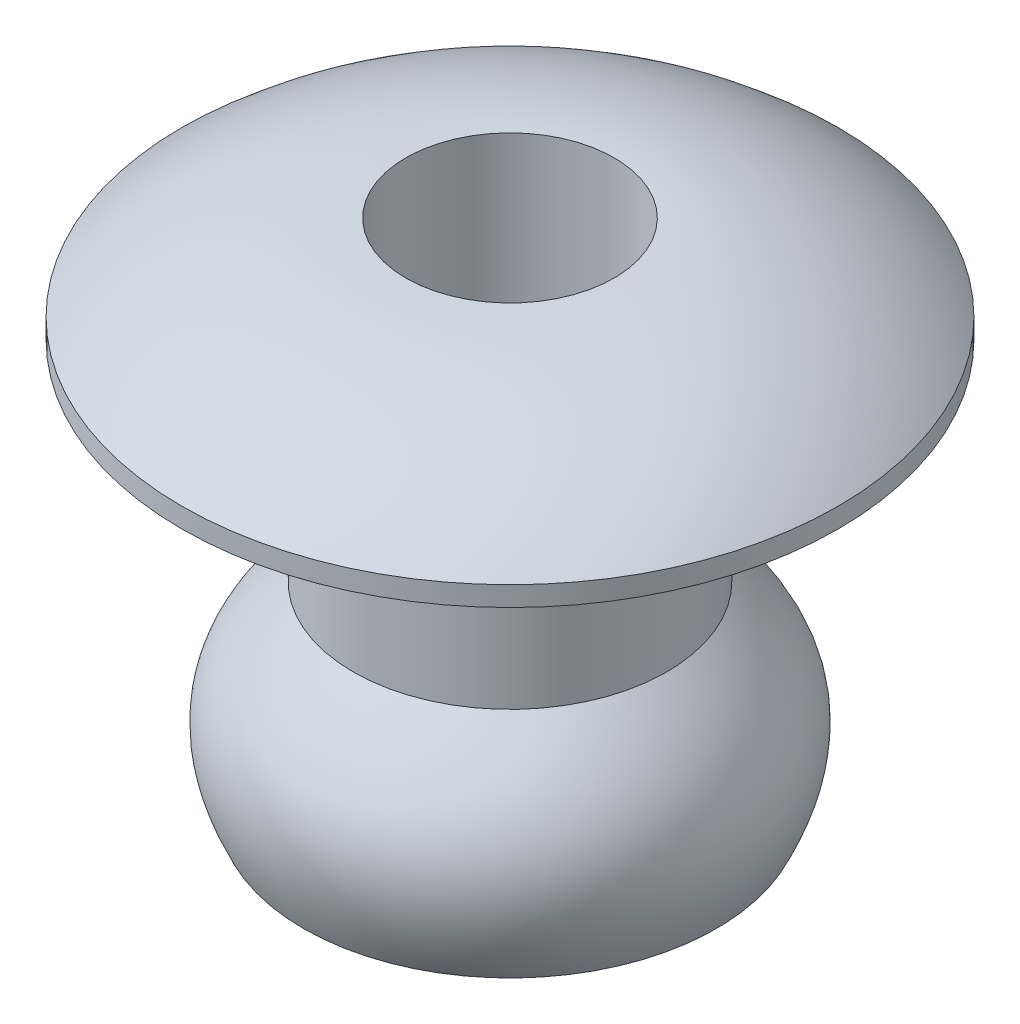
ISO-10303-21;
HEADER;
FILE_DESCRIPTION(('STEP AP214'),'2;1');
FILE_NAME('part.step','',(''),(''),'','','');
FILE_SCHEMA(('AUTOMOTIVE_DESIGN { 1 0 10303 214 1 1 1 1 }'));
ENDSEC;
DATA;
#1=APPLICATION_CONTEXT('core data for automotive mechanical design processes');
#2=APPLICATION_PROTOCOL_DEFINITION('international standard','automotive_design',2000,#1);
#3=PRODUCT_CONTEXT('',#1,'mechanical');
#4=PRODUCT('Part','Part','',(#3));
#5=PRODUCT_RELATED_PRODUCT_CATEGORY('part','',(#4));
#6=PRODUCT_DEFINITION_FORMATION('','',#4);
#7=PRODUCT_DEFINITION_CONTEXT('part definition',#1,'design');
#8=PRODUCT_DEFINITION('design','',#6,#7);
#9=PRODUCT_DEFINITION_SHAPE('','',#8);
#10=(LENGTH_UNIT() NAMED_UNIT(*) SI_UNIT(.MILLI.,.METRE.));
#11=(NAMED_UNIT(*) PLANE_ANGLE_UNIT() SI_UNIT($,.RADIAN.));
#12=(NAMED_UNIT(*) SI_UNIT($,.STERADIAN.) SOLID_ANGLE_UNIT());
#13=UNCERTAINTY_MEASURE_WITH_UNIT(LENGTH_MEASURE(1.E-05),#10,'distance_accuracy_value','');
#14=(GEOMETRIC_REPRESENTATION_CONTEXT(3) GLOBAL_UNCERTAINTY_ASSIGNED_CONTEXT((#13)) GLOBAL_UNIT_ASSIGNED_CONTEXT((#10,
#11,#12)) REPRESENTATION_CONTEXT('',''));
#15=CARTESIAN_POINT('',(0.,0.,0.));
#16=DIRECTION('',(0.,0.,1.));
#17=DIRECTION('',(1.,0.,0.));
#18=AXIS2_PLACEMENT_3D('',#15,#16,#17);
#19=CARTESIAN_POINT('',(0.,0.,2.38125));
#20=DIRECTION('',(0.,-1.,0.));
#21=DIRECTION('',(0.,0.,-1.));
#22=AXIS2_PLACEMENT_3D('',#19,#20,#21);
#23=PLANE('',#22);
#24=CARTESIAN_POINT('',(0.,0.,0.));
#25=DIRECTION('',(0.,1.,0.));
#26=DIRECTION('',(0.,0.,1.));
#27=AXIS2_PLACEMENT_3D('',#24,#25,#26);
#28=CIRCLE('',#27,2.38125);
#29=CARTESIAN_POINT('',(0.,0.,2.38125));
#30=VERTEX_POINT('',#29);
#31=EDGE_CURVE('E10',#30,#30,#28,.T.);
#32=ORIENTED_EDGE('',*,*,#31,.T.);
#33=EDGE_LOOP('',(#32));
#34=FACE_BOUND('',#33,.T.);
#35=CARTESIAN_POINT('',(0.,0.,0.));
#36=DIRECTION('',(0.,1.,0.));
#37=DIRECTION('',(0.,0.,1.));
#38=AXIS2_PLACEMENT_3D('',#35,#36,#37);
#39=CIRCLE('',#38,4.9784);
#40=CARTESIAN_POINT('',(0.,0.,4.9784));
#41=VERTEX_POINT('',#40);
#42=EDGE_CURVE('E67',#41,#41,#39,.T.);
#43=ORIENTED_EDGE('',*,*,#42,.F.);
#44=EDGE_LOOP('',(#43));
#45=FACE_BOUND('',#44,.T.);
#46=ADVANCED_FACE('F30',(#34,#45),#23,.T.);
#47=CARTESIAN_POINT('',(0.,0.,0.));
#48=DIRECTION('',(0.,1.,0.));
#49=DIRECTION('',(0.,0.,1.));
#50=AXIS2_PLACEMENT_3D('',#47,#48,#49);
#51=CYLINDRICAL_SURFACE('',#50,2.38125);
#52=CARTESIAN_POINT('',(0.,-3.175,0.));
#53=DIRECTION('',(0.,1.,0.));
#54=DIRECTION('',(0.,0.,1.));
#55=AXIS2_PLACEMENT_3D('',#52,#53,#54);
#56=CIRCLE('',#55,2.38125);
#57=CARTESIAN_POINT('',(0.,-3.175,2.38125));
#58=VERTEX_POINT('',#57);
#59=EDGE_CURVE('E36',#58,#58,#56,.T.);
#60=ORIENTED_EDGE('',*,*,#59,.T.);
#61=EDGE_LOOP('',(#60));
#62=FACE_BOUND('',#61,.T.);
#63=ORIENTED_EDGE('',*,*,#31,.F.);
#64=EDGE_LOOP('',(#63));
#65=FACE_BOUND('',#64,.T.);
#66=ADVANCED_FACE('F102',(#62,#65),#51,.T.);
#67=CARTESIAN_POINT('',(0.,-3.175,2.38125));
#68=CARTESIAN_POINT('',(0.,-3.98776935881398,3.28520911612403));
#69=CARTESIAN_POINT('',(0.,-4.79609431013514,3.80295234235862));
#70=CARTESIAN_POINT('',(0.,-6.175,3.13125));
#71=B_SPLINE_CURVE_WITH_KNOTS('',3,(#67,#68,#69,#70),.UNSPECIFIED.,.F.,.F.,(4,4),(0.,
0.915818094817049),.UNSPECIFIED.);
#72=CARTESIAN_POINT('',(0.,0.,0.));
#73=DIRECTION('',(0.,1.,0.));
#74=AXIS1_PLACEMENT('',#72,#73);
#75=SURFACE_OF_REVOLUTION('',#71,#74);
#76=CARTESIAN_POINT('',(0.,-6.175,0.));
#77=DIRECTION('',(0.,1.,0.));
#78=DIRECTION('',(0.,0.,1.));
#79=AXIS2_PLACEMENT_3D('',#76,#77,#78);
#80=CIRCLE('',#79,3.13125);
#81=CARTESIAN_POINT('',(0.,-6.175,3.13125));
#82=VERTEX_POINT('',#81);
#83=EDGE_CURVE('E40',#82,#82,#80,.T.);
#84=ORIENTED_EDGE('',*,*,#83,.T.);
#85=EDGE_LOOP('',(#84));
#86=FACE_BOUND('',#85,.T.);
#87=ORIENTED_EDGE('',*,*,#59,.F.);
#88=EDGE_LOOP('',(#87));
#89=FACE_BOUND('',#88,.T.);
#90=ADVANCED_FACE('F99',(#86,#89),#75,.F.);
#91=CARTESIAN_POINT('',(0.,-6.175,2.40132705671076));
#92=DIRECTION('',(0.,-1.,0.));
#93=DIRECTION('',(0.,0.,-1.));
#94=AXIS2_PLACEMENT_3D('',#91,#92,#93);
#95=PLANE('',#94);
#96=CARTESIAN_POINT('',(0.,-6.175,0.));
#97=DIRECTION('',(0.,1.,0.));
#98=DIRECTION('',(0.,0.,1.));
#99=AXIS2_PLACEMENT_3D('',#96,#97,#98);
#100=CIRCLE('',#99,2.40132705671076);
#101=CARTESIAN_POINT('',(0.,-6.175,2.40132705671076));
#102=VERTEX_POINT('',#101);
#103=EDGE_CURVE('E44',#102,#102,#100,.T.);
#104=ORIENTED_EDGE('',*,*,#103,.T.);
#105=EDGE_LOOP('',(#104));
#106=FACE_BOUND('',#105,.T.);
#107=ORIENTED_EDGE('',*,*,#83,.F.);
#108=EDGE_LOOP('',(#107));
#109=FACE_BOUND('',#108,.T.);
#110=ADVANCED_FACE('F95',(#106,#109),#95,.T.);
#111=CARTESIAN_POINT('',(0.,-6.075,0.));
#112=DIRECTION('',(0.,1.,0.));
#113=DIRECTION('',(0.,0.,1.));
#114=AXIS2_PLACEMENT_3D('',#111,#112,#113);
#115=TOROIDAL_SURFACE('',#114,2.40132705671076,0.1);
#116=CARTESIAN_POINT('',(0.,-6.03120686331287,0.));
#117=DIRECTION('',(0.,1.,0.));
#118=DIRECTION('',(0.,0.,1.));
#119=AXIS2_PLACEMENT_3D('',#116,#117,#118);
#120=CIRCLE('',#119,2.31142621589655);
#121=CARTESIAN_POINT('',(0.,-6.03120686331287,2.31142621589655));
#122=VERTEX_POINT('',#121);
#123=EDGE_CURVE('E49',#122,#122,#120,.T.);
#124=ORIENTED_EDGE('',*,*,#123,.T.);
#125=EDGE_LOOP('',(#124));
#126=FACE_BOUND('',#125,.T.);
#127=ORIENTED_EDGE('',*,*,#103,.F.);
#128=EDGE_LOOP('',(#127));
#129=FACE_BOUND('',#128,.T.);
#130=ADVANCED_FACE('F91',(#126,#129),#115,.T.);
#131=CARTESIAN_POINT('',(0.,-6.03120686331287,0.));
#132=DIRECTION('',(0.,1.,0.));
#133=DIRECTION('',(0.,0.,1.));
#134=AXIS2_PLACEMENT_3D('',#131,#132,#133);
#135=CONICAL_SURFACE('',#134,2.31142621589655,0.453296363880323);
#136=CARTESIAN_POINT('',(0.,-5.82465490650294,0.));
#137=DIRECTION('',(0.,1.,0.));
#138=DIRECTION('',(0.,0.,1.));
#139=AXIS2_PLACEMENT_3D('',#136,#137,#138);
#140=CIRCLE('',#139,2.41204327348631);
#141=CARTESIAN_POINT('',(0.,-5.82465490650294,2.41204327348631));
#142=VERTEX_POINT('',#141);
#143=EDGE_CURVE('E52',#142,#142,#140,.T.);
#144=ORIENTED_EDGE('',*,*,#143,.T.);
#145=EDGE_LOOP('',(#144));
#146=FACE_BOUND('',#145,.T.);
#147=ORIENTED_EDGE('',*,*,#123,.F.);
#148=EDGE_LOOP('',(#147));
#149=FACE_BOUND('',#148,.T.);
#150=ADVANCED_FACE('F86',(#146,#149),#135,.F.);
#151=CARTESIAN_POINT('',(0.,-5.82465490650294,2.41204327348631));
#152=CARTESIAN_POINT('',(0.,-5.7023253532171,2.47163331513001));
#153=CARTESIAN_POINT('',(0.,-5.42379247779419,2.58392867309104));
#154=CARTESIAN_POINT('',(0.,-5.1402576923884,2.63865791464232));
#155=CARTESIAN_POINT('',(0.,-4.91103667498342,2.63891641222743));
#156=CARTESIAN_POINT('',(0.,-4.65282889027478,2.58214184539384));
#157=CARTESIAN_POINT('',(0.,-4.3705678955067,2.42624040501684));
#158=CARTESIAN_POINT('',(0.,-4.04310264174956,2.13932134886174));
#159=CARTESIAN_POINT('',(0.,-3.85611024039455,1.94225516811093));
#160=CARTESIAN_POINT('',(0.,-3.76989501848887,1.84636691279577));
#161=B_SPLINE_CURVE_WITH_KNOTS('',3,(#151,#152,#153,#154,#155,#156,#157,#158,#159,#160),
.UNSPECIFIED.,.F.,.F.,(4,1,1,1,1,1,1,4),(0.,0.114477261852131,0.228954523704262,
0.343431785556394,0.457909047408525,0.686863571112787,0.801340832964918,0.915818094817049),.UNSPECIFIED.);
#162=CARTESIAN_POINT('',(0.,0.,0.));
#163=DIRECTION('',(0.,1.,0.));
#164=AXIS1_PLACEMENT('',#162,#163);
#165=SURFACE_OF_REVOLUTION('',#161,#164);
#166=CARTESIAN_POINT('',(0.,-3.76989501848887,0.));
#167=DIRECTION('',(0.,1.,0.));
#168=DIRECTION('',(0.,0.,1.));
#169=AXIS2_PLACEMENT_3D('',#166,#167,#168);
#170=CIRCLE('',#169,1.84636691279577);
#171=CARTESIAN_POINT('',(0.,-3.76989501848887,1.84636691279577));
#172=VERTEX_POINT('',#171);
#173=EDGE_CURVE('E55',#172,#172,#170,.T.);
#174=ORIENTED_EDGE('',*,*,#173,.T.);
#175=EDGE_LOOP('',(#174));
#176=FACE_BOUND('',#175,.T.);
#177=ORIENTED_EDGE('',*,*,#143,.F.);
#178=EDGE_LOOP('',(#177));
#179=FACE_BOUND('',#178,.T.);
#180=ADVANCED_FACE('F81',(#176,#179),#165,.F.);
#181=CARTESIAN_POINT('',(0.,-3.76989501848887,0.));
#182=DIRECTION('',(0.,-1.,0.));
#183=DIRECTION('',(0.,0.,-1.));
#184=AXIS2_PLACEMENT_3D('',#181,#182,#183);
#185=CONICAL_SURFACE('',#184,1.84636691279577,0.838466623454227);
#186=CARTESIAN_POINT('',(0.,-3.53152261936126,0.));
#187=DIRECTION('',(0.,1.,0.));
#188=DIRECTION('',(0.,0.,1.));
#189=AXIS2_PLACEMENT_3D('',#186,#187,#188);
#190=CIRCLE('',#189,1.58125);
#191=CARTESIAN_POINT('',(0.,-3.53152261936126,1.58125));
#192=VERTEX_POINT('',#191);
#193=EDGE_CURVE('E58',#192,#192,#190,.T.);
#194=ORIENTED_EDGE('',*,*,#193,.T.);
#195=EDGE_LOOP('',(#194));
#196=FACE_BOUND('',#195,.T.);
#197=ORIENTED_EDGE('',*,*,#173,.F.);
#198=EDGE_LOOP('',(#197));
#199=FACE_BOUND('',#198,.T.);
#200=ADVANCED_FACE('F85',(#196,#199),#185,.F.);
#201=CARTESIAN_POINT('',(0.,0.,0.));
#202=DIRECTION('',(0.,1.,0.));
#203=DIRECTION('',(0.,0.,1.));
#204=AXIS2_PLACEMENT_3D('',#201,#202,#203);
#205=CYLINDRICAL_SURFACE('',#204,1.58125);
#206=CARTESIAN_POINT('',(0.,1.6002,0.));
#207=DIRECTION('',(0.,1.,0.));
#208=DIRECTION('',(0.,0.,1.));
#209=AXIS2_PLACEMENT_3D('',#206,#207,#208);
#210=CIRCLE('',#209,1.58125);
#211=CARTESIAN_POINT('',(0.,1.6002,1.58125));
#212=VERTEX_POINT('',#211);
#213=EDGE_CURVE('E61',#212,#212,#210,.T.);
#214=ORIENTED_EDGE('',*,*,#213,.T.);
#215=EDGE_LOOP('',(#214));
#216=FACE_BOUND('',#215,.T.);
#217=ORIENTED_EDGE('',*,*,#193,.F.);
#218=EDGE_LOOP('',(#217));
#219=FACE_BOUND('',#218,.T.);
#220=ADVANCED_FACE('F123',(#216,#219),#205,.F.);
#221=CARTESIAN_POINT('',(0.,-3.48792035167666,0.));
#222=DIRECTION('',(0.,1.,0.));
#223=DIRECTION('',(0.,0.,1.));
#224=AXIS2_PLACEMENT_3D('',#221,#222,#223);
#225=DEGENERATE_TOROIDAL_SURFACE('',#224,1.58125,5.08812035167666,.T.);
#226=CARTESIAN_POINT('',(0.,0.300000000000001,0.));
#227=DIRECTION('',(0.,1.,0.));
#228=DIRECTION('',(0.,0.,1.));
#229=AXIS2_PLACEMENT_3D('',#226,#227,#228);
#230=CIRCLE('',#229,4.9784);
#231=CARTESIAN_POINT('',(0.,0.300000000000001,4.9784));
#232=VERTEX_POINT('',#231);
#233=EDGE_CURVE('E64',#232,#232,#230,.T.);
#234=ORIENTED_EDGE('',*,*,#233,.T.);
#235=EDGE_LOOP('',(#234));
#236=FACE_BOUND('',#235,.T.);
#237=ORIENTED_EDGE('',*,*,#213,.F.);
#238=EDGE_LOOP('',(#237));
#239=FACE_BOUND('',#238,.T.);
#240=ADVANCED_FACE('F117',(#236,#239),#225,.T.);
#241=CARTESIAN_POINT('',(0.,0.,0.));
#242=DIRECTION('',(0.,1.,0.));
#243=DIRECTION('',(0.,0.,1.));
#244=AXIS2_PLACEMENT_3D('',#241,#242,#243);
#245=CYLINDRICAL_SURFACE('',#244,4.9784);
#246=ORIENTED_EDGE('',*,*,#42,.T.);
#247=EDGE_LOOP('',(#246));
#248=FACE_BOUND('',#247,.T.);
#249=ORIENTED_EDGE('',*,*,#233,.F.);
#250=EDGE_LOOP('',(#249));
#251=FACE_BOUND('',#250,.T.);
#252=ADVANCED_FACE('F114',(#248,#251),#245,.T.);
#253=CLOSED_SHELL('',(#46,#66,#90,#110,#130,#150,#180,#200,#220,#240,#252));
#254=MANIFOLD_SOLID_BREP('B2',#253);
#255=ADVANCED_BREP_SHAPE_REPRESENTATION('',(#18,#254),#14);
#256=SHAPE_DEFINITION_REPRESENTATION(#9,#255);
ENDSEC;
END-ISO-10303-21;
